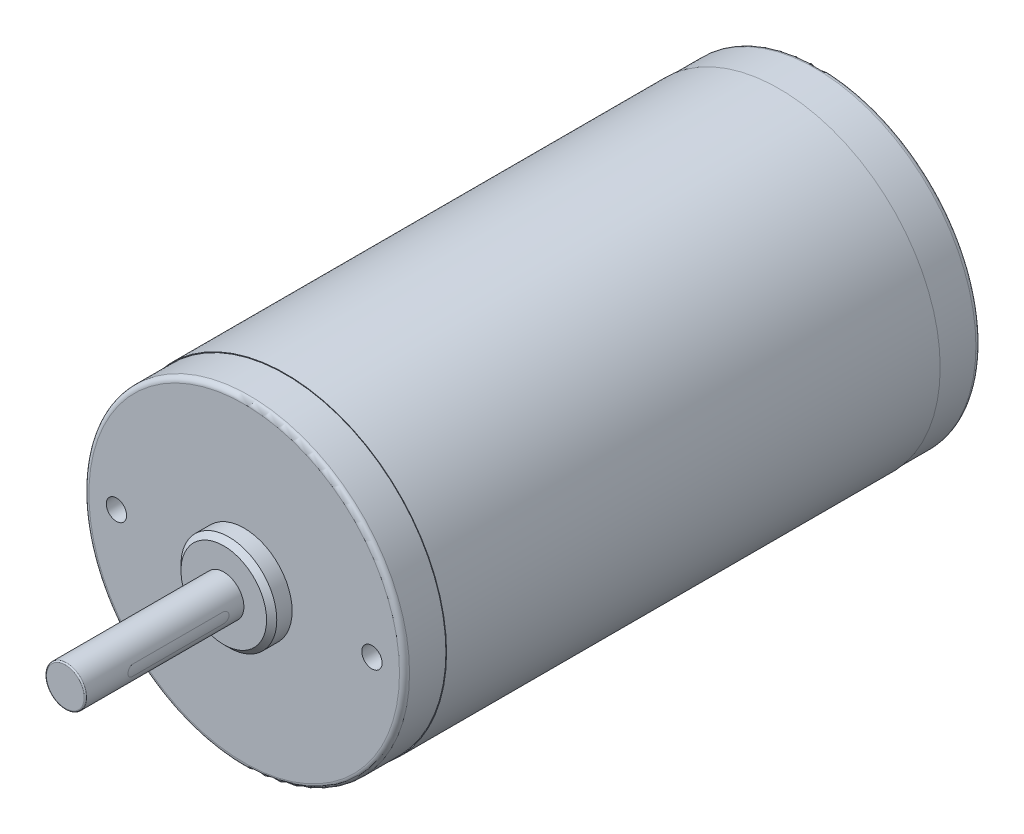
ISO-10303-21;
HEADER;
FILE_DESCRIPTION(('STEP AP214'),'2;1');
FILE_NAME('part.step','',(''),(''),'','','');
FILE_SCHEMA(('AUTOMOTIVE_DESIGN { 1 0 10303 214 1 1 1 1 }'));
ENDSEC;
DATA;
#1=APPLICATION_CONTEXT('core data for automotive mechanical design processes');
#2=APPLICATION_PROTOCOL_DEFINITION('international standard','automotive_design',2000,#1);
#3=PRODUCT_CONTEXT('',#1,'mechanical');
#4=PRODUCT('Part','Part','',(#3));
#5=PRODUCT_RELATED_PRODUCT_CATEGORY('part','',(#4));
#6=PRODUCT_DEFINITION_FORMATION('','',#4);
#7=PRODUCT_DEFINITION_CONTEXT('part definition',#1,'design');
#8=PRODUCT_DEFINITION('design','',#6,#7);
#9=PRODUCT_DEFINITION_SHAPE('','',#8);
#10=(LENGTH_UNIT() NAMED_UNIT(*) SI_UNIT(.MILLI.,.METRE.));
#11=(NAMED_UNIT(*) PLANE_ANGLE_UNIT() SI_UNIT($,.RADIAN.));
#12=(NAMED_UNIT(*) SI_UNIT($,.STERADIAN.) SOLID_ANGLE_UNIT());
#13=UNCERTAINTY_MEASURE_WITH_UNIT(LENGTH_MEASURE(1.E-05),#10,'distance_accuracy_value','');
#14=(GEOMETRIC_REPRESENTATION_CONTEXT(3) GLOBAL_UNCERTAINTY_ASSIGNED_CONTEXT((#13)) GLOBAL_UNIT_ASSIGNED_CONTEXT((#10,
#11,#12)) REPRESENTATION_CONTEXT('',''));
#15=CARTESIAN_POINT('',(0.,0.,0.));
#16=DIRECTION('',(0.,0.,1.));
#17=DIRECTION('',(1.,0.,0.));
#18=AXIS2_PLACEMENT_3D('',#15,#16,#17);
#19=CARTESIAN_POINT('',(35.56,109.2962,10.8204000000007));
#20=DIRECTION('',(0.,0.,-1.));
#21=DIRECTION('',(-1.,0.,0.));
#22=AXIS2_PLACEMENT_3D('',#19,#20,#21);
#23=CYLINDRICAL_SURFACE('',#22,32.0040000000005);
#24=CARTESIAN_POINT('',(35.56,109.2962,10.8204000000007));
#25=DIRECTION('',(0.,0.,-1.));
#26=DIRECTION('',(-1.,0.,0.));
#27=AXIS2_PLACEMENT_3D('',#24,#25,#26);
#28=CIRCLE('',#27,32.0040000000005);
#29=CARTESIAN_POINT('',(3.5559999999995,109.2962,10.8204000000007));
#30=VERTEX_POINT('',#29);
#31=EDGE_CURVE('P0_E178',#30,#30,#28,.T.);
#32=ORIENTED_EDGE('',*,*,#31,.T.);
#33=EDGE_LOOP('',(#32));
#34=FACE_BOUND('',#33,.T.);
#35=CARTESIAN_POINT('',(35.56,109.2962,-87.325199999998));
#36=DIRECTION('',(0.,0.,-1.));
#37=DIRECTION('',(-1.,0.,0.));
#38=AXIS2_PLACEMENT_3D('',#35,#36,#37);
#39=CIRCLE('',#38,32.0040000000005);
#40=CARTESIAN_POINT('',(3.5559999999995,109.2962,-87.325199999998));
#41=VERTEX_POINT('',#40);
#42=EDGE_CURVE('P0_E175',#41,#41,#39,.T.);
#43=ORIENTED_EDGE('',*,*,#42,.F.);
#44=EDGE_LOOP('',(#43));
#45=FACE_BOUND('',#44,.T.);
#46=ADVANCED_FACE('P0_F36',(#34,#45),#23,.T.);
#47=CARTESIAN_POINT('',(67.5640000000005,109.2962,10.8204000000007));
#48=DIRECTION('',(0.,0.,1.));
#49=DIRECTION('',(1.,0.,0.));
#50=AXIS2_PLACEMENT_3D('',#47,#48,#49);
#51=PLANE('',#50);
#52=CARTESIAN_POINT('',(35.56,109.2962,10.8204000000007));
#53=DIRECTION('',(0.,0.,1.));
#54=DIRECTION('',(1.,0.,0.));
#55=AXIS2_PLACEMENT_3D('',#52,#53,#54);
#56=CIRCLE('',#55,31.8770000000005);
#57=CARTESIAN_POINT('',(67.4370000000005,109.2962,10.8204000000007));
#58=VERTEX_POINT('',#57);
#59=EDGE_CURVE('P0_E166',#58,#58,#56,.T.);
#60=ORIENTED_EDGE('',*,*,#59,.F.);
#61=EDGE_LOOP('',(#60));
#62=FACE_BOUND('',#61,.T.);
#63=ORIENTED_EDGE('',*,*,#31,.F.);
#64=EDGE_LOOP('',(#63));
#65=FACE_BOUND('',#64,.T.);
#66=ADVANCED_FACE('P0_F225',(#62,#65),#51,.T.);
#67=CARTESIAN_POINT('',(35.56,109.2962,-87.325199999998));
#68=DIRECTION('',(0.,0.,-1.));
#69=DIRECTION('',(-1.,0.,0.));
#70=AXIS2_PLACEMENT_3D('',#67,#68,#69);
#71=PLANE('',#70);
#72=CARTESIAN_POINT('',(35.56,109.2962,-87.325199999998));
#73=DIRECTION('',(0.,0.,-1.));
#74=DIRECTION('',(-1.,0.,0.));
#75=AXIS2_PLACEMENT_3D('',#72,#73,#74);
#76=CIRCLE('',#75,31.8770000000005);
#77=CARTESIAN_POINT('',(3.68299999999951,109.2962,-87.325199999998));
#78=VERTEX_POINT('',#77);
#79=EDGE_CURVE('P0_E172',#78,#78,#76,.T.);
#80=ORIENTED_EDGE('',*,*,#79,.F.);
#81=EDGE_LOOP('',(#80));
#82=FACE_BOUND('',#81,.T.);
#83=ORIENTED_EDGE('',*,*,#42,.T.);
#84=EDGE_LOOP('',(#83));
#85=FACE_BOUND('',#84,.T.);
#86=ADVANCED_FACE('P0_F231',(#82,#85),#71,.T.);
#87=CARTESIAN_POINT('',(35.56,109.2962,-95.554799999998));
#88=DIRECTION('',(0.,0.,1.));
#89=DIRECTION('',(1.,0.,0.));
#90=AXIS2_PLACEMENT_3D('',#87,#88,#89);
#91=CYLINDRICAL_SURFACE('',#90,31.8770000000005);
#92=CARTESIAN_POINT('',(35.56,109.2962,-94.554799999998));
#93=DIRECTION('',(0.,0.,-1.));
#94=DIRECTION('',(-1.,0.,0.));
#95=AXIS2_PLACEMENT_3D('',#92,#93,#94);
#96=CIRCLE('',#95,31.8770000000005);
#97=CARTESIAN_POINT('',(3.68299999999951,109.2962,-94.554799999998));
#98=VERTEX_POINT('',#97);
#99=EDGE_CURVE('P0_E208',#98,#98,#96,.F.);
#100=ORIENTED_EDGE('',*,*,#99,.T.);
#101=EDGE_LOOP('',(#100));
#102=FACE_BOUND('',#101,.T.);
#103=ORIENTED_EDGE('',*,*,#79,.T.);
#104=EDGE_LOOP('',(#103));
#105=FACE_BOUND('',#104,.T.);
#106=ADVANCED_FACE('P0_F289',(#102,#105),#91,.T.);
#107=CARTESIAN_POINT('',(35.56,109.2962,-95.554799999998));
#108=DIRECTION('',(0.,0.,-1.));
#109=DIRECTION('',(-1.,0.,0.));
#110=AXIS2_PLACEMENT_3D('',#107,#108,#109);
#111=PLANE('',#110);
#112=CARTESIAN_POINT('',(35.56,109.2962,-95.554799999998));
#113=DIRECTION('',(0.,0.,-1.));
#114=DIRECTION('',(-1.,0.,0.));
#115=AXIS2_PLACEMENT_3D('',#112,#113,#114);
#116=CIRCLE('',#115,30.8770000000005);
#117=CARTESIAN_POINT('',(4.6829999999995,109.2962,-95.554799999998));
#118=VERTEX_POINT('',#117);
#119=EDGE_CURVE('P0_E205',#118,#118,#116,.T.);
#120=ORIENTED_EDGE('',*,*,#119,.T.);
#121=EDGE_LOOP('',(#120));
#122=FACE_BOUND('',#121,.T.);
#123=CARTESIAN_POINT('',(46.76735963712,127.903290682857,-95.554799999998));
#124=DIRECTION('',(0.,0.,-1.));
#125=DIRECTION('',(-1.,0.,0.));
#126=AXIS2_PLACEMENT_3D('',#123,#124,#125);
#127=CIRCLE('',#126,4.31800000197918);
#128=CARTESIAN_POINT('',(42.4493596351408,127.903290682857,-95.554799999998));
#129=VERTEX_POINT('',#128);
#130=EDGE_CURVE('P0_E184',#129,#129,#127,.T.);
#131=ORIENTED_EDGE('',*,*,#130,.F.);
#132=EDGE_LOOP('',(#131));
#133=FACE_BOUND('',#132,.T.);
#134=CARTESIAN_POINT('',(54.1670906808811,120.503559639095,-95.554799999998));
#135=DIRECTION('',(0.,0.,-1.));
#136=DIRECTION('',(-1.,0.,0.));
#137=AXIS2_PLACEMENT_3D('',#134,#135,#136);
#138=CIRCLE('',#137,4.3180000019652);
#139=CARTESIAN_POINT('',(49.8490906789159,120.503559639095,-95.554799999998));
#140=VERTEX_POINT('',#139);
#141=EDGE_CURVE('P0_E181',#140,#140,#138,.T.);
#142=ORIENTED_EDGE('',*,*,#141,.F.);
#143=EDGE_LOOP('',(#142));
#144=FACE_BOUND('',#143,.T.);
#145=CARTESIAN_POINT('',(35.56,109.2962,-95.554799999998));
#146=DIRECTION('',(0.,0.,-1.));
#147=DIRECTION('',(-1.,0.,0.));
#148=AXIS2_PLACEMENT_3D('',#145,#146,#147);
#149=CIRCLE('',#148,15.0368000000003);
#150=CARTESIAN_POINT('',(20.5231999999997,109.2962,-95.554799999998));
#151=VERTEX_POINT('',#150);
#152=EDGE_CURVE('P0_E169',#151,#151,#149,.T.);
#153=ORIENTED_EDGE('',*,*,#152,.F.);
#154=EDGE_LOOP('',(#153));
#155=FACE_BOUND('',#154,.T.);
#156=ADVANCED_FACE('P0_F285',(#122,#133,#144,#155),#111,.T.);
#157=CARTESIAN_POINT('',(35.56,109.2962,-100.317299999998));
#158=DIRECTION('',(0.,0.,1.));
#159=DIRECTION('',(1.,0.,0.));
#160=AXIS2_PLACEMENT_3D('',#157,#158,#159);
#161=CYLINDRICAL_SURFACE('',#160,15.0368000000003);
#162=CARTESIAN_POINT('',(35.56,109.2962,-99.317299999998));
#163=DIRECTION('',(0.,0.,-1.));
#164=DIRECTION('',(-1.,0.,0.));
#165=AXIS2_PLACEMENT_3D('',#162,#163,#164);
#166=CIRCLE('',#165,15.0368000000003);
#167=CARTESIAN_POINT('',(20.5231999999997,109.2962,-99.317299999998));
#168=VERTEX_POINT('',#167);
#169=EDGE_CURVE('P0_E11',#168,#168,#166,.F.);
#170=ORIENTED_EDGE('',*,*,#169,.T.);
#171=EDGE_LOOP('',(#170));
#172=FACE_BOUND('',#171,.T.);
#173=ORIENTED_EDGE('',*,*,#152,.T.);
#174=EDGE_LOOP('',(#173));
#175=FACE_BOUND('',#174,.T.);
#176=ADVANCED_FACE('P0_F282',(#172,#175),#161,.T.);
#177=CARTESIAN_POINT('',(35.56,109.2962,-100.317299999998));
#178=DIRECTION('',(0.,0.,-1.));
#179=DIRECTION('',(-1.,0.,0.));
#180=AXIS2_PLACEMENT_3D('',#177,#178,#179);
#181=PLANE('',#180);
#182=CARTESIAN_POINT('',(35.56,109.2962,-100.317299999998));
#183=DIRECTION('',(0.,0.,-1.));
#184=DIRECTION('',(-1.,0.,0.));
#185=AXIS2_PLACEMENT_3D('',#182,#183,#184);
#186=CIRCLE('',#185,14.0368000000003);
#187=CARTESIAN_POINT('',(21.5231999999997,109.2962,-100.317299999998));
#188=VERTEX_POINT('',#187);
#189=EDGE_CURVE('P0_E44',#188,#188,#186,.T.);
#190=ORIENTED_EDGE('',*,*,#189,.T.);
#191=EDGE_LOOP('',(#190));
#192=FACE_BOUND('',#191,.T.);
#193=ADVANCED_FACE('P0_F213',(#192),#181,.T.);
#194=CARTESIAN_POINT('',(35.56,109.2962,19.05));
#195=DIRECTION('',(0.,0.,-1.));
#196=DIRECTION('',(-1.,0.,0.));
#197=AXIS2_PLACEMENT_3D('',#194,#195,#196);
#198=CYLINDRICAL_SURFACE('',#197,31.8770000000005);
#199=CARTESIAN_POINT('',(35.56,109.2962,18.05));
#200=DIRECTION('',(0.,0.,1.));
#201=DIRECTION('',(1.,0.,0.));
#202=AXIS2_PLACEMENT_3D('',#199,#200,#201);
#203=CIRCLE('',#202,31.8770000000005);
#204=CARTESIAN_POINT('',(67.4370000000005,109.2962,18.05));
#205=VERTEX_POINT('',#204);
#206=EDGE_CURVE('P0_E202',#205,#205,#203,.F.);
#207=ORIENTED_EDGE('',*,*,#206,.T.);
#208=EDGE_LOOP('',(#207));
#209=FACE_BOUND('',#208,.T.);
#210=ORIENTED_EDGE('',*,*,#59,.T.);
#211=EDGE_LOOP('',(#210));
#212=FACE_BOUND('',#211,.T.);
#213=ADVANCED_FACE('P0_F257',(#209,#212),#198,.T.);
#214=CARTESIAN_POINT('',(35.56,109.2962,19.05));
#215=DIRECTION('',(0.,0.,1.));
#216=DIRECTION('',(1.,0.,0.));
#217=AXIS2_PLACEMENT_3D('',#214,#215,#216);
#218=PLANE('',#217);
#219=CARTESIAN_POINT('',(35.56,109.2962,19.05));
#220=DIRECTION('',(0.,0.,1.));
#221=DIRECTION('',(1.,0.,0.));
#222=AXIS2_PLACEMENT_3D('',#219,#220,#221);
#223=CIRCLE('',#222,30.8770000000005);
#224=CARTESIAN_POINT('',(66.4370000000005,109.2962,19.05));
#225=VERTEX_POINT('',#224);
#226=EDGE_CURVE('P0_E199',#225,#225,#223,.T.);
#227=ORIENTED_EDGE('',*,*,#226,.T.);
#228=EDGE_LOOP('',(#227));
#229=FACE_BOUND('',#228,.T.);
#230=CARTESIAN_POINT('',(10.1599999999994,109.2962,19.05));
#231=DIRECTION('',(0.,0.,1.));
#232=DIRECTION('',(1.,0.,0.));
#233=AXIS2_PLACEMENT_3D('',#230,#231,#232);
#234=CIRCLE('',#233,2.01930000000002);
#235=CARTESIAN_POINT('',(12.1792999999994,109.2962,19.05));
#236=VERTEX_POINT('',#235);
#237=EDGE_CURVE('P0_E93',#236,#236,#234,.T.);
#238=ORIENTED_EDGE('',*,*,#237,.F.);
#239=EDGE_LOOP('',(#238));
#240=FACE_BOUND('',#239,.T.);
#241=CARTESIAN_POINT('',(60.96,109.2962,19.05));
#242=DIRECTION('',(0.,0.,1.));
#243=DIRECTION('',(1.,0.,0.));
#244=AXIS2_PLACEMENT_3D('',#241,#242,#243);
#245=CIRCLE('',#244,2.01930000000002);
#246=CARTESIAN_POINT('',(62.9793,109.2962,19.05));
#247=VERTEX_POINT('',#246);
#248=EDGE_CURVE('P0_E92',#247,#247,#245,.T.);
#249=ORIENTED_EDGE('',*,*,#248,.F.);
#250=EDGE_LOOP('',(#249));
#251=FACE_BOUND('',#250,.T.);
#252=CARTESIAN_POINT('',(35.56,109.2962,19.05));
#253=DIRECTION('',(0.,0.,1.));
#254=DIRECTION('',(1.,0.,0.));
#255=AXIS2_PLACEMENT_3D('',#252,#253,#254);
#256=CIRCLE('',#255,9.52500000000019);
#257=CARTESIAN_POINT('',(45.0850000000002,109.2962,19.05));
#258=VERTEX_POINT('',#257);
#259=EDGE_CURVE('P0_E163',#258,#258,#256,.T.);
#260=ORIENTED_EDGE('',*,*,#259,.F.);
#261=EDGE_LOOP('',(#260));
#262=FACE_BOUND('',#261,.T.);
#263=ADVANCED_FACE('P0_F253',(#229,#240,#251,#262),#218,.T.);
#264=CARTESIAN_POINT('',(35.56,109.2962,23.114));
#265=DIRECTION('',(0.,0.,-1.));
#266=DIRECTION('',(-1.,0.,0.));
#267=AXIS2_PLACEMENT_3D('',#264,#265,#266);
#268=CYLINDRICAL_SURFACE('',#267,9.52500000000019);
#269=CARTESIAN_POINT('',(35.56,109.2962,22.0980000018232));
#270=DIRECTION('',(0.,0.,1.));
#271=DIRECTION('',(1.,0.,0.));
#272=AXIS2_PLACEMENT_3D('',#269,#270,#271);
#273=CIRCLE('',#272,9.52500000000019);
#274=CARTESIAN_POINT('',(45.0850000000002,109.2962,22.0980000018232));
#275=VERTEX_POINT('',#274);
#276=EDGE_CURVE('P0_E190',#275,#275,#273,.F.);
#277=ORIENTED_EDGE('',*,*,#276,.T.);
#278=EDGE_LOOP('',(#277));
#279=FACE_BOUND('',#278,.T.);
#280=ORIENTED_EDGE('',*,*,#259,.T.);
#281=EDGE_LOOP('',(#280));
#282=FACE_BOUND('',#281,.T.);
#283=ADVANCED_FACE('P0_F256',(#279,#282),#268,.T.);
#284=CARTESIAN_POINT('',(35.56,109.2962,23.114));
#285=DIRECTION('',(0.,0.,1.));
#286=DIRECTION('',(1.,0.,0.));
#287=AXIS2_PLACEMENT_3D('',#284,#285,#286);
#288=PLANE('',#287);
#289=CARTESIAN_POINT('',(35.56,109.2962,23.114));
#290=DIRECTION('',(0.,0.,1.));
#291=DIRECTION('',(1.,0.,0.));
#292=AXIS2_PLACEMENT_3D('',#289,#290,#291);
#293=CIRCLE('',#292,8.50899999999979);
#294=CARTESIAN_POINT('',(44.0689999999998,109.2962,23.114));
#295=VERTEX_POINT('',#294);
#296=EDGE_CURVE('P0_E187',#295,#295,#293,.T.);
#297=ORIENTED_EDGE('',*,*,#296,.T.);
#298=EDGE_LOOP('',(#297));
#299=FACE_BOUND('',#298,.T.);
#300=CARTESIAN_POINT('',(35.56,109.2962,23.114));
#301=DIRECTION('',(0.,0.,1.));
#302=DIRECTION('',(1.,0.,0.));
#303=AXIS2_PLACEMENT_3D('',#300,#301,#302);
#304=CIRCLE('',#303,4.00000000000007);
#305=CARTESIAN_POINT('',(39.5600000000001,109.2962,23.114));
#306=VERTEX_POINT('',#305);
#307=EDGE_CURVE('P0_E119',#306,#306,#304,.T.);
#308=ORIENTED_EDGE('',*,*,#307,.F.);
#309=EDGE_LOOP('',(#308));
#310=FACE_BOUND('',#309,.T.);
#311=ADVANCED_FACE('P0_F266',(#299,#310),#288,.T.);
#312=CARTESIAN_POINT('',(35.56,109.2962,54.614));
#313=DIRECTION('',(0.,0.,-1.));
#314=DIRECTION('',(-1.,0.,0.));
#315=AXIS2_PLACEMENT_3D('',#312,#313,#314);
#316=CYLINDRICAL_SURFACE('',#315,4.00000000000007);
#317=CARTESIAN_POINT('',(35.56,109.2962,54.36));
#318=DIRECTION('',(0.,0.,1.));
#319=DIRECTION('',(1.,0.,0.));
#320=AXIS2_PLACEMENT_3D('',#317,#318,#319);
#321=CIRCLE('',#320,4.00000000000007);
#322=CARTESIAN_POINT('',(39.5600000000001,109.2962,54.36));
#323=VERTEX_POINT('',#322);
#324=EDGE_CURVE('P0_E196',#323,#323,#321,.F.);
#325=ORIENTED_EDGE('',*,*,#324,.T.);
#326=EDGE_LOOP('',(#325));
#327=FACE_BOUND('',#326,.T.);
#328=DIRECTION('',(0.,0.,-1.));
#329=VECTOR('',#328,1.);
#330=CARTESIAN_POINT('',(39.4197279696891,110.3462,54.614));
#331=LINE('',#330,#329);
#332=CARTESIAN_POINT('',(39.4197279696891,110.3462,45.1));
#333=VERTEX_POINT('',#332);
#334=CARTESIAN_POINT('',(39.4197279696891,110.3462,27.1));
#335=VERTEX_POINT('',#334);
#336=EDGE_CURVE('P0_E129',#333,#335,#331,.T.);
#337=ORIENTED_EDGE('',*,*,#336,.T.);
#338=CARTESIAN_POINT('',(39.4197279696891,110.3462,27.1));
#339=CARTESIAN_POINT('',(39.4197258950768,110.34620041025,27.0710051009623));
#340=CARTESIAN_POINT('',(39.4200551064329,110.344998227256,27.0420246228058));
#341=CARTESIAN_POINT('',(39.4213547123988,110.340206209835,26.9842814282389));
#342=CARTESIAN_POINT('',(39.4223249908093,110.336616808112,26.9555186733196));
#343=CARTESIAN_POINT('',(39.4261578920524,110.322321932764,26.8699951160553));
#344=CARTESIAN_POINT('',(39.4299428342912,110.308089542303,26.8138236492985));
#345=CARTESIAN_POINT('',(39.4395286889104,110.270686835054,26.7047742036821));
#346=CARTESIAN_POINT('',(39.445329326456,110.247517736714,26.6518957769836));
#347=CARTESIAN_POINT('',(39.4582892232805,110.192930496084,26.5507488556207));
#348=CARTESIAN_POINT('',(39.4654488628844,110.161510043656,26.5024816571346));
#349=CARTESIAN_POINT('',(39.4805119710478,110.090509636998,26.4107922298844));
#350=CARTESIAN_POINT('',(39.4884281885094,110.050767743087,26.3674975328551));
#351=CARTESIAN_POINT('',(39.5040047400555,109.964586854037,26.2880931254825));
#352=CARTESIAN_POINT('',(39.5116649818293,109.91814547434,26.2519859843525));
#353=CARTESIAN_POINT('',(39.526010604883,109.818987620195,26.1874496103786));
#354=CARTESIAN_POINT('',(39.5326785635433,109.766183168704,26.159151481312));
#355=CARTESIAN_POINT('',(39.5441298010583,109.656397945762,26.1119111599868));
#356=CARTESIAN_POINT('',(39.5489153447307,109.599422291421,26.0929577177131));
#357=CARTESIAN_POINT('',(39.5549473168842,109.501171577289,26.0693758272655));
#358=CARTESIAN_POINT('',(39.5568321627736,109.46054623456,26.0621227253234));
#359=CARTESIAN_POINT('',(39.5593590428507,109.378686103609,26.052433965248));
#360=CARTESIAN_POINT('',(39.560001100914,109.337451327111,26.0499982145665));
#361=CARTESIAN_POINT('',(39.5599984549201,109.238305738357,26.0500025057704));
#362=CARTESIAN_POINT('',(39.5587300938834,109.18037887734,26.0548061723029));
#363=CARTESIAN_POINT('',(39.5537908073877,109.066174828257,26.0738680806171));
#364=CARTESIAN_POINT('',(39.5501176251492,109.009899241695,26.0881352034471));
#365=CARTESIAN_POINT('',(39.5407752151886,108.900688958064,26.1256289904428));
#366=CARTESIAN_POINT('',(39.5351088856793,108.847749541003,26.148842650214));
#367=CARTESIAN_POINT('',(39.5223803452478,108.746519851806,26.2035277086069));
#368=CARTESIAN_POINT('',(39.5153181479083,108.698229534436,26.2349990268771));
#369=CARTESIAN_POINT('',(39.5003832391547,108.606575585264,26.3060552920619));
#370=CARTESIAN_POINT('',(39.4924970081334,108.563331555532,26.3457916691671));
#371=CARTESIAN_POINT('',(39.4768899553604,108.484036309153,26.431929982209));
#372=CARTESIAN_POINT('',(39.4691691622905,108.447986330864,26.4783330633665));
#373=CARTESIAN_POINT('',(39.4546281048764,108.383519395399,26.5774412854526));
#374=CARTESIAN_POINT('',(39.447825217303,108.355241372008,26.6302394851058));
#375=CARTESIAN_POINT('',(39.4360941322255,108.308025058775,26.7400354515098));
#376=CARTESIAN_POINT('',(39.4311644713835,108.289079475123,26.7970298984879));
#377=CARTESIAN_POINT('',(39.424947536189,108.265530062073,26.8952701656664));
#378=CARTESIAN_POINT('',(39.4230031721686,108.258293447667,26.9358624533813));
#379=CARTESIAN_POINT('',(39.4203876966156,108.248624950633,27.0176289590907));
#380=CARTESIAN_POINT('',(39.419715789786,108.246190066839,27.058802797386));
#381=CARTESIAN_POINT('',(39.4197279696891,108.2462,27.1));
#382=B_SPLINE_CURVE_WITH_KNOTS('',3,(#338,#339,#340,#341,#342,#343,#344,#345,#346,#347,#348,
#349,#350,#351,#352,#353,#354,#355,#356,#357,#358,#359,#360,#361,#362,#363,#364,#365,#366,#367,
#368,#369,#370,#371,#372,#373,#374,#375,#376,#377,#378,#379,#380,#381),.UNSPECIFIED.,.F.,.F.,(4,
2,2,2,2,2,2,2,2,2,2,2,2,2,2,2,2,2,2,2,2,4),(0.,0.0869295778834455,0.173843403286115,
0.347151826879623,0.520436629596136,0.693769998810197,0.870856390838592,1.0480059697082,
1.22797015523124,1.40771715061754,1.53136439682191,1.65500926755904,1.82853892099358,
2.00223165541559,2.17567286221396,2.34911238140168,2.52606492372391,2.7030478997598,
2.88301467869372,3.06284057971519,3.18638852057381,3.30985921734618),.UNSPECIFIED.);
#383=CARTESIAN_POINT('',(39.4197279696891,108.2462,27.1));
#384=VERTEX_POINT('',#383);
#385=EDGE_CURVE('P0_E115',#335,#384,#382,.T.);
#386=ORIENTED_EDGE('',*,*,#385,.T.);
#387=DIRECTION('',(0.,0.,-1.));
#388=VECTOR('',#387,1.);
#389=CARTESIAN_POINT('',(39.4197279696891,108.2462,54.614));
#390=LINE('',#389,#388);
#391=CARTESIAN_POINT('',(39.4197279696891,108.2462,45.1));
#392=VERTEX_POINT('',#391);
#393=EDGE_CURVE('P0_E142',#384,#392,#390,.F.);
#394=ORIENTED_EDGE('',*,*,#393,.T.);
#395=CARTESIAN_POINT('',(39.4197279696891,108.2462,45.1));
#396=CARTESIAN_POINT('',(39.4197258950768,108.24619958975,45.1289948990377));
#397=CARTESIAN_POINT('',(39.4200551064328,108.247401772744,45.1579753771942));
#398=CARTESIAN_POINT('',(39.4213547123988,108.252193790165,45.2157185717611));
#399=CARTESIAN_POINT('',(39.4223249908093,108.255783191888,45.2444813266804));
#400=CARTESIAN_POINT('',(39.4261578920524,108.270078067236,45.3300048839447));
#401=CARTESIAN_POINT('',(39.4299428342912,108.284310457697,45.3861763507014));
#402=CARTESIAN_POINT('',(39.4395286889104,108.321713164946,45.4952257963179));
#403=CARTESIAN_POINT('',(39.445329326456,108.344882263286,45.5481042230163));
#404=CARTESIAN_POINT('',(39.4582892232805,108.399469503916,45.6492511443793));
#405=CARTESIAN_POINT('',(39.4654488628844,108.430889956344,45.6975183428654));
#406=CARTESIAN_POINT('',(39.4805119710478,108.501890363002,45.7892077701155));
#407=CARTESIAN_POINT('',(39.4884281885094,108.541632256913,45.8325024671448));
#408=CARTESIAN_POINT('',(39.5040047400555,108.627813145963,45.9119068745175));
#409=CARTESIAN_POINT('',(39.5116649818293,108.67425452566,45.9480140156475));
#410=CARTESIAN_POINT('',(39.526010604883,108.773412379805,46.0125503896214));
#411=CARTESIAN_POINT('',(39.5326785635433,108.826216831296,46.040848518688));
#412=CARTESIAN_POINT('',(39.5441298010583,108.936002054238,46.0880888400132));
#413=CARTESIAN_POINT('',(39.5489153447307,108.992977708579,46.1070422822868));
#414=CARTESIAN_POINT('',(39.5549473168842,109.091228422711,46.1306241727345));
#415=CARTESIAN_POINT('',(39.5568321627736,109.13185376544,46.1378772746766));
#416=CARTESIAN_POINT('',(39.5593590428507,109.213713896391,46.147566034752));
#417=CARTESIAN_POINT('',(39.560001100914,109.254948672889,46.1500017854335));
#418=CARTESIAN_POINT('',(39.5599984549201,109.354094261643,46.1499974942296));
#419=CARTESIAN_POINT('',(39.5587300938834,109.412021122661,46.1451938276971));
#420=CARTESIAN_POINT('',(39.5537908073877,109.526225171743,46.1261319193829));
#421=CARTESIAN_POINT('',(39.5501176251492,109.582500758305,46.1118647965529));
#422=CARTESIAN_POINT('',(39.5407752151886,109.691711041936,46.0743710095572));
#423=CARTESIAN_POINT('',(39.5351088856793,109.744650458997,46.051157349786));
#424=CARTESIAN_POINT('',(39.5223803452478,109.845880148194,45.9964722913931));
#425=CARTESIAN_POINT('',(39.5153181479083,109.894170465564,45.9650009731229));
#426=CARTESIAN_POINT('',(39.5003832391547,109.985824414736,45.8939447079381));
#427=CARTESIAN_POINT('',(39.4924970081334,110.029068444468,45.8542083308329));
#428=CARTESIAN_POINT('',(39.4768899553604,110.108363690847,45.768070017791));
#429=CARTESIAN_POINT('',(39.4691691622905,110.144413669136,45.7216669366335));
#430=CARTESIAN_POINT('',(39.4546281048764,110.208880604601,45.6225587145474));
#431=CARTESIAN_POINT('',(39.447825217303,110.237158627992,45.5697605148942));
#432=CARTESIAN_POINT('',(39.4360941322255,110.284374941225,45.4599645484902));
#433=CARTESIAN_POINT('',(39.4311644713835,110.303320524877,45.4029701015121));
#434=CARTESIAN_POINT('',(39.424947536189,110.326869937927,45.3047298343336));
#435=CARTESIAN_POINT('',(39.4230031721686,110.334106552333,45.2641375466187));
#436=CARTESIAN_POINT('',(39.4203876966156,110.343775049367,45.1823710409093));
#437=CARTESIAN_POINT('',(39.419715789786,110.346209933161,45.141197202614));
#438=CARTESIAN_POINT('',(39.4197279696891,110.3462,45.1));
#439=B_SPLINE_CURVE_WITH_KNOTS('',3,(#395,#396,#397,#398,#399,#400,#401,#402,#403,#404,#405,
#406,#407,#408,#409,#410,#411,#412,#413,#414,#415,#416,#417,#418,#419,#420,#421,#422,#423,#424,
#425,#426,#427,#428,#429,#430,#431,#432,#433,#434,#435,#436,#437,#438),.UNSPECIFIED.,.F.,.F.,(4,
2,2,2,2,2,2,2,2,2,2,2,2,2,2,2,2,2,2,2,2,4),(0.,0.0869295778834422,0.17384340328612,
0.347151826879625,0.520436629596116,0.69376999881019,0.870856390838584,1.04800596970821,
1.22797015523126,1.40771715061754,1.53136439682193,1.65500926755904,1.82853892099362,
2.0022316554156,2.17567286221397,2.34911238140169,2.52606492372393,2.70304789975981,
2.88301467869373,3.0628405797152,3.18638852057382,3.3098592173462),.UNSPECIFIED.);
#440=EDGE_CURVE('P0_E51',#392,#333,#439,.T.);
#441=ORIENTED_EDGE('',*,*,#440,.T.);
#442=EDGE_LOOP('',(#337,#386,#394,#441));
#443=FACE_BOUND('',#442,.T.);
#444=ORIENTED_EDGE('',*,*,#307,.T.);
#445=EDGE_LOOP('',(#444));
#446=FACE_BOUND('',#445,.T.);
#447=ADVANCED_FACE('P0_F272',(#327,#443,#446),#316,.T.);
#448=CARTESIAN_POINT('',(35.56,109.2962,54.614));
#449=DIRECTION('',(0.,0.,1.));
#450=DIRECTION('',(1.,0.,0.));
#451=AXIS2_PLACEMENT_3D('',#448,#449,#450);
#452=PLANE('',#451);
#453=CARTESIAN_POINT('',(35.56,109.2962,54.614));
#454=DIRECTION('',(0.,0.,1.));
#455=DIRECTION('',(1.,0.,0.));
#456=AXIS2_PLACEMENT_3D('',#453,#454,#455);
#457=CIRCLE('',#456,3.74600000000007);
#458=CARTESIAN_POINT('',(39.3060000000001,109.2962,54.614));
#459=VERTEX_POINT('',#458);
#460=EDGE_CURVE('P0_E193',#459,#459,#457,.T.);
#461=ORIENTED_EDGE('',*,*,#460,.T.);
#462=EDGE_LOOP('',(#461));
#463=FACE_BOUND('',#462,.T.);
#464=ADVANCED_FACE('P0_F482',(#463),#452,.T.);
#465=CARTESIAN_POINT('',(67.5650000000005,109.2962,27.1));
#466=DIRECTION('',(-1.,0.,0.));
#467=DIRECTION('',(0.,0.,1.));
#468=AXIS2_PLACEMENT_3D('',#465,#466,#467);
#469=CYLINDRICAL_SURFACE('',#468,1.05);
#470=ORIENTED_EDGE('',*,*,#385,.F.);
#471=DIRECTION('',(-1.,0.,0.));
#472=VECTOR('',#471,1.);
#473=CARTESIAN_POINT('',(67.5650000000005,110.3462,27.1));
#474=LINE('',#473,#472);
#475=CARTESIAN_POINT('',(38.3600000000001,110.3462,27.1));
#476=VERTEX_POINT('',#475);
#477=EDGE_CURVE('P0_E133',#335,#476,#474,.T.);
#478=ORIENTED_EDGE('',*,*,#477,.T.);
#479=CARTESIAN_POINT('',(38.3600000000001,109.2962,27.1));
#480=DIRECTION('',(-1.,0.,0.));
#481=DIRECTION('',(0.,0.,1.));
#482=AXIS2_PLACEMENT_3D('',#479,#480,#481);
#483=CIRCLE('',#482,1.05);
#484=CARTESIAN_POINT('',(38.3600000000001,108.2462,27.1));
#485=VERTEX_POINT('',#484);
#486=EDGE_CURVE('P0_E126',#476,#485,#483,.T.);
#487=ORIENTED_EDGE('',*,*,#486,.T.);
#488=DIRECTION('',(-1.,0.,0.));
#489=VECTOR('',#488,1.);
#490=CARTESIAN_POINT('',(67.5650000000005,108.2462,27.1));
#491=LINE('',#490,#489);
#492=EDGE_CURVE('P0_E59',#384,#485,#491,.T.);
#493=ORIENTED_EDGE('',*,*,#492,.F.);
#494=EDGE_LOOP('',(#470,#478,#487,#493));
#495=FACE_BOUND('',#494,.T.);
#496=ADVANCED_FACE('P0_F473',(#495),#469,.F.);
#497=CARTESIAN_POINT('',(67.5650000000005,110.3462,45.1));
#498=DIRECTION('',(0.,1.,0.));
#499=DIRECTION('',(0.,0.,1.));
#500=AXIS2_PLACEMENT_3D('',#497,#498,#499);
#501=PLANE('',#500);
#502=ORIENTED_EDGE('',*,*,#336,.F.);
#503=DIRECTION('',(-1.,0.,0.));
#504=VECTOR('',#503,1.);
#505=CARTESIAN_POINT('',(67.5650000000005,110.3462,45.1));
#506=LINE('',#505,#504);
#507=CARTESIAN_POINT('',(38.3600000000001,110.3462,45.1));
#508=VERTEX_POINT('',#507);
#509=EDGE_CURVE('P0_E156',#333,#508,#506,.T.);
#510=ORIENTED_EDGE('',*,*,#509,.T.);
#511=DIRECTION('',(0.,0.,-1.));
#512=VECTOR('',#511,1.);
#513=CARTESIAN_POINT('',(38.3600000000001,110.3462,45.1));
#514=LINE('',#513,#512);
#515=EDGE_CURVE('P0_E116',#508,#476,#514,.T.);
#516=ORIENTED_EDGE('',*,*,#515,.T.);
#517=ORIENTED_EDGE('',*,*,#477,.F.);
#518=EDGE_LOOP('',(#502,#510,#516,#517));
#519=FACE_BOUND('',#518,.T.);
#520=ADVANCED_FACE('P0_F465',(#519),#501,.F.);
#521=CARTESIAN_POINT('',(67.5650000000005,109.2962,45.1));
#522=DIRECTION('',(-1.,0.,0.));
#523=DIRECTION('',(0.,0.,1.));
#524=AXIS2_PLACEMENT_3D('',#521,#522,#523);
#525=CYLINDRICAL_SURFACE('',#524,1.05);
#526=ORIENTED_EDGE('',*,*,#440,.F.);
#527=DIRECTION('',(-1.,0.,0.));
#528=VECTOR('',#527,1.);
#529=CARTESIAN_POINT('',(67.5650000000005,108.2462,45.1));
#530=LINE('',#529,#528);
#531=CARTESIAN_POINT('',(38.3600000000001,108.2462,45.1));
#532=VERTEX_POINT('',#531);
#533=EDGE_CURVE('P0_E128',#392,#532,#530,.T.);
#534=ORIENTED_EDGE('',*,*,#533,.T.);
#535=CARTESIAN_POINT('',(38.3600000000001,109.2962,45.1));
#536=DIRECTION('',(-1.,0.,0.));
#537=DIRECTION('',(0.,0.,1.));
#538=AXIS2_PLACEMENT_3D('',#535,#536,#537);
#539=CIRCLE('',#538,1.05);
#540=EDGE_CURVE('P0_E120',#532,#508,#539,.T.);
#541=ORIENTED_EDGE('',*,*,#540,.T.);
#542=ORIENTED_EDGE('',*,*,#509,.F.);
#543=EDGE_LOOP('',(#526,#534,#541,#542));
#544=FACE_BOUND('',#543,.T.);
#545=ADVANCED_FACE('P0_F457',(#544),#525,.F.);
#546=CARTESIAN_POINT('',(67.5650000000005,108.2462,27.1));
#547=DIRECTION('',(0.,-1.,0.));
#548=DIRECTION('',(0.,0.,-1.));
#549=AXIS2_PLACEMENT_3D('',#546,#547,#548);
#550=PLANE('',#549);
#551=ORIENTED_EDGE('',*,*,#393,.F.);
#552=ORIENTED_EDGE('',*,*,#492,.T.);
#553=DIRECTION('',(0.,0.,1.));
#554=VECTOR('',#553,1.);
#555=CARTESIAN_POINT('',(38.3600000000001,108.2462,27.1));
#556=LINE('',#555,#554);
#557=EDGE_CURVE('P0_E123',#485,#532,#556,.T.);
#558=ORIENTED_EDGE('',*,*,#557,.T.);
#559=ORIENTED_EDGE('',*,*,#533,.F.);
#560=EDGE_LOOP('',(#551,#552,#558,#559));
#561=FACE_BOUND('',#560,.T.);
#562=ADVANCED_FACE('P0_F449',(#561),#550,.F.);
#563=CARTESIAN_POINT('',(38.3600000000001,109.2962,27.1));
#564=DIRECTION('',(-1.,0.,0.));
#565=DIRECTION('',(0.,0.,1.));
#566=AXIS2_PLACEMENT_3D('',#563,#564,#565);
#567=PLANE('',#566);
#568=ORIENTED_EDGE('',*,*,#486,.F.);
#569=ORIENTED_EDGE('',*,*,#515,.F.);
#570=ORIENTED_EDGE('',*,*,#540,.F.);
#571=ORIENTED_EDGE('',*,*,#557,.F.);
#572=EDGE_LOOP('',(#568,#569,#570,#571));
#573=FACE_BOUND('',#572,.T.);
#574=ADVANCED_FACE('P0_F440',(#573),#567,.F.);
#575=CARTESIAN_POINT('',(54.1670906808811,120.503559639095,-95.554799999998));
#576=DIRECTION('',(0.,0.,-1.));
#577=DIRECTION('',(-1.,0.,0.));
#578=AXIS2_PLACEMENT_3D('',#575,#576,#577);
#579=CYLINDRICAL_SURFACE('',#578,4.3180000019652);
#580=ORIENTED_EDGE('',*,*,#141,.T.);
#581=EDGE_LOOP('',(#580));
#582=FACE_BOUND('',#581,.T.);
#583=CARTESIAN_POINT('',(54.1670906808811,120.503559639095,-95.6026999960083));
#584=DIRECTION('',(0.,0.,-1.));
#585=DIRECTION('',(-1.,0.,0.));
#586=AXIS2_PLACEMENT_3D('',#583,#584,#585);
#587=CIRCLE('',#586,4.3180000019652);
#588=CARTESIAN_POINT('',(49.8490906789159,120.503559639095,-95.6026999960083));
#589=VERTEX_POINT('',#588);
#590=EDGE_CURVE('P0_E109',#589,#589,#587,.T.);
#591=ORIENTED_EDGE('',*,*,#590,.F.);
#592=EDGE_LOOP('',(#591));
#593=FACE_BOUND('',#592,.T.);
#594=ADVANCED_FACE('P0_F431',(#582,#593),#579,.T.);
#595=CARTESIAN_POINT('',(54.1670906808811,120.503559639095,-97.8026999980238));
#596=DIRECTION('',(0.,0.,-1.));
#597=DIRECTION('',(-1.,0.,0.));
#598=AXIS2_PLACEMENT_3D('',#595,#596,#597);
#599=PLANE('',#598);
#600=CARTESIAN_POINT('',(54.1670906808811,120.503559639095,-97.8026999980238));
#601=DIRECTION('',(0.,0.,-1.));
#602=DIRECTION('',(-1.,0.,0.));
#603=AXIS2_PLACEMENT_3D('',#600,#601,#602);
#604=CIRCLE('',#603,2.11799999994966);
#605=CARTESIAN_POINT('',(52.0490906809314,120.503559639095,-97.8026999980238));
#606=VERTEX_POINT('',#605);
#607=EDGE_CURVE('P0_E112',#606,#606,#604,.T.);
#608=ORIENTED_EDGE('',*,*,#607,.T.);
#609=EDGE_LOOP('',(#608));
#610=FACE_BOUND('',#609,.T.);
#611=ADVANCED_FACE('P0_F422',(#610),#599,.T.);
#612=CARTESIAN_POINT('',(54.1670906808811,120.503559639095,-97.8026999980238));
#613=DIRECTION('',(0.,0.,1.));
#614=DIRECTION('',(1.,0.,0.));
#615=AXIS2_PLACEMENT_3D('',#612,#613,#614);
#616=CONICAL_SURFACE('',#615,2.11799999994966,0.78539816339745);
#617=ORIENTED_EDGE('',*,*,#590,.T.);
#618=EDGE_LOOP('',(#617));
#619=FACE_BOUND('',#618,.T.);
#620=ORIENTED_EDGE('',*,*,#607,.F.);
#621=EDGE_LOOP('',(#620));
#622=FACE_BOUND('',#621,.T.);
#623=ADVANCED_FACE('P0_F413',(#619,#622),#616,.T.);
#624=CARTESIAN_POINT('',(46.76735963712,127.903290682857,-95.554799999998));
#625=DIRECTION('',(0.,0.,-1.));
#626=DIRECTION('',(-1.,0.,0.));
#627=AXIS2_PLACEMENT_3D('',#624,#625,#626);
#628=CYLINDRICAL_SURFACE('',#627,4.31800000197918);
#629=ORIENTED_EDGE('',*,*,#130,.T.);
#630=EDGE_LOOP('',(#629));
#631=FACE_BOUND('',#630,.T.);
#632=CARTESIAN_POINT('',(46.76735963712,127.903290682857,-95.6026999960785));
#633=DIRECTION('',(0.,0.,-1.));
#634=DIRECTION('',(-1.,0.,0.));
#635=AXIS2_PLACEMENT_3D('',#632,#633,#634);
#636=CIRCLE('',#635,4.31800000197918);
#637=CARTESIAN_POINT('',(42.4493596351408,127.903290682857,-95.6026999960785));
#638=VERTEX_POINT('',#637);
#639=EDGE_CURVE('P0_E103',#638,#638,#636,.T.);
#640=ORIENTED_EDGE('',*,*,#639,.F.);
#641=EDGE_LOOP('',(#640));
#642=FACE_BOUND('',#641,.T.);
#643=ADVANCED_FACE('P0_F404',(#631,#642),#628,.T.);
#644=CARTESIAN_POINT('',(46.76735963712,127.903290682857,-97.8026999980236));
#645=DIRECTION('',(0.,0.,-1.));
#646=DIRECTION('',(-1.,0.,0.));
#647=AXIS2_PLACEMENT_3D('',#644,#645,#646);
#648=PLANE('',#647);
#649=CARTESIAN_POINT('',(46.76735963712,127.903290682857,-97.8026999980236));
#650=DIRECTION('',(0.,0.,-1.));
#651=DIRECTION('',(-1.,0.,0.));
#652=AXIS2_PLACEMENT_3D('',#649,#650,#651);
#653=CIRCLE('',#652,2.11800000003411);
#654=CARTESIAN_POINT('',(44.6493596370859,127.903290682857,-97.8026999980236));
#655=VERTEX_POINT('',#654);
#656=EDGE_CURVE('P0_E106',#655,#655,#653,.T.);
#657=ORIENTED_EDGE('',*,*,#656,.T.);
#658=EDGE_LOOP('',(#657));
#659=FACE_BOUND('',#658,.T.);
#660=ADVANCED_FACE('P0_F395',(#659),#648,.T.);
#661=CARTESIAN_POINT('',(46.76735963712,127.903290682857,-97.8026999980236));
#662=DIRECTION('',(0.,0.,1.));
#663=DIRECTION('',(1.,0.,0.));
#664=AXIS2_PLACEMENT_3D('',#661,#662,#663);
#665=CONICAL_SURFACE('',#664,2.11800000003411,0.785398163397448);
#666=ORIENTED_EDGE('',*,*,#639,.T.);
#667=EDGE_LOOP('',(#666));
#668=FACE_BOUND('',#667,.T.);
#669=ORIENTED_EDGE('',*,*,#656,.F.);
#670=EDGE_LOOP('',(#669));
#671=FACE_BOUND('',#670,.T.);
#672=ADVANCED_FACE('P0_F386',(#668,#671),#665,.T.);
#673=CARTESIAN_POINT('',(60.96,109.2962,5.4356000000007));
#674=DIRECTION('',(0.,0.,1.));
#675=DIRECTION('',(1.,0.,0.));
#676=AXIS2_PLACEMENT_3D('',#673,#674,#675);
#677=CONICAL_SURFACE('',#676,2.01930000000002,1.02974425747654);
#678=CARTESIAN_POINT('',(60.96,109.2962,4.22228214870002));
#679=VERTEX_POINT('',#678);
#680=VERTEX_LOOP('',#679);
#681=FACE_BOUND('',#680,.T.);
#682=CARTESIAN_POINT('',(60.96,109.2962,5.4356000000007));
#683=DIRECTION('',(0.,0.,1.));
#684=DIRECTION('',(1.,0.,0.));
#685=AXIS2_PLACEMENT_3D('',#682,#683,#684);
#686=CIRCLE('',#685,2.01930000000002);
#687=CARTESIAN_POINT('',(62.9793,109.2962,5.4356000000007));
#688=VERTEX_POINT('',#687);
#689=EDGE_CURVE('P0_E96',#688,#688,#686,.T.);
#690=ORIENTED_EDGE('',*,*,#689,.T.);
#691=EDGE_LOOP('',(#690));
#692=FACE_BOUND('',#691,.T.);
#693=ADVANCED_FACE('P0_F377',(#681,#692),#677,.F.);
#694=CARTESIAN_POINT('',(60.96,109.2962,19.05));
#695=DIRECTION('',(0.,0.,1.));
#696=DIRECTION('',(1.,0.,0.));
#697=AXIS2_PLACEMENT_3D('',#694,#695,#696);
#698=CYLINDRICAL_SURFACE('',#697,2.01930000000002);
#699=ORIENTED_EDGE('',*,*,#689,.F.);
#700=EDGE_LOOP('',(#699));
#701=FACE_BOUND('',#700,.T.);
#702=ORIENTED_EDGE('',*,*,#248,.T.);
#703=EDGE_LOOP('',(#702));
#704=FACE_BOUND('',#703,.T.);
#705=ADVANCED_FACE('P0_F86',(#701,#704),#698,.F.);
#706=CARTESIAN_POINT('',(10.1599999999994,109.2962,5.4356000000007));
#707=DIRECTION('',(0.,0.,1.));
#708=DIRECTION('',(1.,0.,0.));
#709=AXIS2_PLACEMENT_3D('',#706,#707,#708);
#710=CONICAL_SURFACE('',#709,2.01930000000002,1.02974425747654);
#711=CARTESIAN_POINT('',(10.1599999999994,109.2962,4.22228214870002));
#712=VERTEX_POINT('',#711);
#713=VERTEX_LOOP('',#712);
#714=FACE_BOUND('',#713,.T.);
#715=CARTESIAN_POINT('',(10.1599999999994,109.2962,5.4356000000007));
#716=DIRECTION('',(0.,0.,1.));
#717=DIRECTION('',(1.,0.,0.));
#718=AXIS2_PLACEMENT_3D('',#715,#716,#717);
#719=CIRCLE('',#718,2.01930000000002);
#720=CARTESIAN_POINT('',(12.1792999999994,109.2962,5.4356000000007));
#721=VERTEX_POINT('',#720);
#722=EDGE_CURVE('P0_E90',#721,#721,#719,.T.);
#723=ORIENTED_EDGE('',*,*,#722,.T.);
#724=EDGE_LOOP('',(#723));
#725=FACE_BOUND('',#724,.T.);
#726=ADVANCED_FACE('P0_F82',(#714,#725),#710,.F.);
#727=CARTESIAN_POINT('',(10.1599999999994,109.2962,19.05));
#728=DIRECTION('',(0.,0.,1.));
#729=DIRECTION('',(1.,0.,0.));
#730=AXIS2_PLACEMENT_3D('',#727,#728,#729);
#731=CYLINDRICAL_SURFACE('',#730,2.01930000000002);
#732=ORIENTED_EDGE('',*,*,#722,.F.);
#733=EDGE_LOOP('',(#732));
#734=FACE_BOUND('',#733,.T.);
#735=ORIENTED_EDGE('',*,*,#237,.T.);
#736=EDGE_LOOP('',(#735));
#737=FACE_BOUND('',#736,.T.);
#738=ADVANCED_FACE('P0_F85',(#734,#737),#731,.F.);
#739=CARTESIAN_POINT('',(35.56,109.2962,23.114));
#740=DIRECTION('',(0.,0.,-1.));
#741=DIRECTION('',(-1.,0.,0.));
#742=AXIS2_PLACEMENT_3D('',#739,#740,#741);
#743=CONICAL_SURFACE('',#742,8.50899999999979,0.785398164294876);
#744=ORIENTED_EDGE('',*,*,#276,.F.);
#745=EDGE_LOOP('',(#744));
#746=FACE_BOUND('',#745,.T.);
#747=ORIENTED_EDGE('',*,*,#296,.F.);
#748=EDGE_LOOP('',(#747));
#749=FACE_BOUND('',#748,.T.);
#750=ADVANCED_FACE('P0_F237',(#746,#749),#743,.T.);
#751=CARTESIAN_POINT('',(35.56,109.2962,54.36));
#752=DIRECTION('',(0.,0.,1.));
#753=DIRECTION('',(1.,0.,0.));
#754=AXIS2_PLACEMENT_3D('',#751,#752,#753);
#755=TOROIDAL_SURFACE('',#754,3.74600000000007,0.254000000000003);
#756=ORIENTED_EDGE('',*,*,#324,.F.);
#757=EDGE_LOOP('',(#756));
#758=FACE_BOUND('',#757,.T.);
#759=ORIENTED_EDGE('',*,*,#460,.F.);
#760=EDGE_LOOP('',(#759));
#761=FACE_BOUND('',#760,.T.);
#762=ADVANCED_FACE('P0_F240',(#758,#761),#755,.T.);
#763=CARTESIAN_POINT('',(35.56,109.2962,18.05));
#764=DIRECTION('',(0.,0.,1.));
#765=DIRECTION('',(1.,0.,0.));
#766=AXIS2_PLACEMENT_3D('',#763,#764,#765);
#767=TOROIDAL_SURFACE('',#766,30.8770000000005,0.999999999999998);
#768=ORIENTED_EDGE('',*,*,#206,.F.);
#769=EDGE_LOOP('',(#768));
#770=FACE_BOUND('',#769,.T.);
#771=ORIENTED_EDGE('',*,*,#226,.F.);
#772=EDGE_LOOP('',(#771));
#773=FACE_BOUND('',#772,.T.);
#774=ADVANCED_FACE('P0_F221',(#770,#773),#767,.T.);
#775=CARTESIAN_POINT('',(35.56,109.2962,-94.554799999998));
#776=DIRECTION('',(0.,0.,-1.));
#777=DIRECTION('',(-1.,0.,0.));
#778=AXIS2_PLACEMENT_3D('',#775,#776,#777);
#779=TOROIDAL_SURFACE('',#778,30.8770000000005,0.999999999999998);
#780=ORIENTED_EDGE('',*,*,#99,.F.);
#781=EDGE_LOOP('',(#780));
#782=FACE_BOUND('',#781,.T.);
#783=ORIENTED_EDGE('',*,*,#119,.F.);
#784=EDGE_LOOP('',(#783));
#785=FACE_BOUND('',#784,.T.);
#786=ADVANCED_FACE('P0_F216',(#782,#785),#779,.T.);
#787=CARTESIAN_POINT('',(35.56,109.2962,-99.317299999998));
#788=DIRECTION('',(0.,0.,-1.));
#789=DIRECTION('',(-1.,0.,0.));
#790=AXIS2_PLACEMENT_3D('',#787,#788,#789);
#791=TOROIDAL_SURFACE('',#790,14.0368000000003,0.999999999999998);
#792=ORIENTED_EDGE('',*,*,#169,.F.);
#793=EDGE_LOOP('',(#792));
#794=FACE_BOUND('',#793,.T.);
#795=ORIENTED_EDGE('',*,*,#189,.F.);
#796=EDGE_LOOP('',(#795));
#797=FACE_BOUND('',#796,.T.);
#798=ADVANCED_FACE('P0_F38',(#794,#797),#791,.T.);
#799=CLOSED_SHELL('',(#46,#66,#86,#106,#156,#176,#193,#213,#263,#283,#311,#447,#464,#496,#520,
#545,#562,#574,#594,#611,#623,#643,#660,#672,#693,#705,#726,#738,#750,#762,#774,#786,#798));
#800=MANIFOLD_SOLID_BREP('P0_B2',#799);
#801=CARTESIAN_POINT('',(35.56,109.2962,54.614));
#802=DIRECTION('',(0.,0.,-1.));
#803=DIRECTION('',(-1.,0.,0.));
#804=AXIS2_PLACEMENT_3D('',#801,#802,#803);
#805=CYLINDRICAL_SURFACE('',#804,4.00000000000007);
#806=CARTESIAN_POINT('',(39.4197279696891,108.2462,45.1));
#807=CARTESIAN_POINT('',(39.4197258950768,108.24619958975,45.1289948990377));
#808=CARTESIAN_POINT('',(39.4200551064328,108.247401772744,45.1579753771942));
#809=CARTESIAN_POINT('',(39.4213547123988,108.252193790165,45.2157185717611));
#810=CARTESIAN_POINT('',(39.4223249908093,108.255783191888,45.2444813266804));
#811=CARTESIAN_POINT('',(39.4261578920524,108.270078067236,45.3300048839447));
#812=CARTESIAN_POINT('',(39.4299428342912,108.284310457697,45.3861763507014));
#813=CARTESIAN_POINT('',(39.4395286889104,108.321713164946,45.4952257963179));
#814=CARTESIAN_POINT('',(39.445329326456,108.344882263286,45.5481042230163));
#815=CARTESIAN_POINT('',(39.4582892232805,108.399469503916,45.6492511443793));
#816=CARTESIAN_POINT('',(39.4654488628844,108.430889956344,45.6975183428654));
#817=CARTESIAN_POINT('',(39.4805119710478,108.501890363002,45.7892077701155));
#818=CARTESIAN_POINT('',(39.4884281885094,108.541632256913,45.8325024671448));
#819=CARTESIAN_POINT('',(39.5040047400555,108.627813145963,45.9119068745175));
#820=CARTESIAN_POINT('',(39.5116649818293,108.67425452566,45.9480140156475));
#821=CARTESIAN_POINT('',(39.526010604883,108.773412379805,46.0125503896214));
#822=CARTESIAN_POINT('',(39.5326785635433,108.826216831296,46.040848518688));
#823=CARTESIAN_POINT('',(39.5441298010583,108.936002054238,46.0880888400132));
#824=CARTESIAN_POINT('',(39.5489153447307,108.992977708579,46.1070422822868));
#825=CARTESIAN_POINT('',(39.5549473168842,109.091228422711,46.1306241727345));
#826=CARTESIAN_POINT('',(39.5568321627736,109.13185376544,46.1378772746766));
#827=CARTESIAN_POINT('',(39.5593590428507,109.213713896391,46.147566034752));
#828=CARTESIAN_POINT('',(39.560001100914,109.254948672889,46.1500017854335));
#829=CARTESIAN_POINT('',(39.5599984549201,109.354094261643,46.1499974942296));
#830=CARTESIAN_POINT('',(39.5587300938834,109.412021122661,46.1451938276971));
#831=CARTESIAN_POINT('',(39.5537908073877,109.526225171743,46.1261319193829));
#832=CARTESIAN_POINT('',(39.5501176251492,109.582500758305,46.1118647965529));
#833=CARTESIAN_POINT('',(39.5407752151886,109.691711041936,46.0743710095572));
#834=CARTESIAN_POINT('',(39.5351088856793,109.744650458997,46.051157349786));
#835=CARTESIAN_POINT('',(39.5223803452478,109.845880148194,45.9964722913931));
#836=CARTESIAN_POINT('',(39.5153181479083,109.894170465564,45.9650009731229));
#837=CARTESIAN_POINT('',(39.5003832391547,109.985824414736,45.8939447079381));
#838=CARTESIAN_POINT('',(39.4924970081334,110.029068444468,45.8542083308329));
#839=CARTESIAN_POINT('',(39.4768899553604,110.108363690847,45.768070017791));
#840=CARTESIAN_POINT('',(39.4691691622905,110.144413669136,45.7216669366335));
#841=CARTESIAN_POINT('',(39.4546281048764,110.208880604601,45.6225587145474));
#842=CARTESIAN_POINT('',(39.447825217303,110.237158627992,45.5697605148942));
#843=CARTESIAN_POINT('',(39.4360941322255,110.284374941225,45.4599645484902));
#844=CARTESIAN_POINT('',(39.4311644713835,110.303320524877,45.4029701015121));
#845=CARTESIAN_POINT('',(39.424947536189,110.326869937927,45.3047298343336));
#846=CARTESIAN_POINT('',(39.4230031721686,110.334106552333,45.2641375466187));
#847=CARTESIAN_POINT('',(39.4203876966156,110.343775049367,45.1823710409093));
#848=CARTESIAN_POINT('',(39.419715789786,110.346209933161,45.141197202614));
#849=CARTESIAN_POINT('',(39.4197279696891,110.3462,45.1));
#850=B_SPLINE_CURVE_WITH_KNOTS('',3,(#806,#807,#808,#809,#810,#811,#812,#813,#814,#815,#816,
#817,#818,#819,#820,#821,#822,#823,#824,#825,#826,#827,#828,#829,#830,#831,#832,#833,#834,#835,
#836,#837,#838,#839,#840,#841,#842,#843,#844,#845,#846,#847,#848,#849),.UNSPECIFIED.,.F.,.F.,(4,
2,2,2,2,2,2,2,2,2,2,2,2,2,2,2,2,2,2,2,2,4),(0.,0.0869295778834422,0.17384340328612,
0.347151826879625,0.520436629596116,0.69376999881019,0.870856390838584,1.04800596970821,
1.22797015523126,1.40771715061754,1.53136439682193,1.65500926755904,1.82853892099362,
2.0022316554156,2.17567286221397,2.34911238140169,2.52606492372393,2.70304789975981,
2.88301467869373,3.0628405797152,3.18638852057382,3.3098592173462),.UNSPECIFIED.);
#851=CARTESIAN_POINT('',(39.4197279696891,108.2462,45.1));
#852=VERTEX_POINT('',#851);
#853=CARTESIAN_POINT('',(39.4197279696891,110.3462,45.1));
#854=VERTEX_POINT('',#853);
#855=EDGE_CURVE('P1_E27',#852,#854,#850,.T.);
#856=ORIENTED_EDGE('',*,*,#855,.F.);
#857=DIRECTION('',(0.,0.,-1.));
#858=VECTOR('',#857,1.);
#859=CARTESIAN_POINT('',(39.4197279696891,108.2462,54.614));
#860=LINE('',#859,#858);
#861=CARTESIAN_POINT('',(39.4197279696891,108.2462,27.1));
#862=VERTEX_POINT('',#861);
#863=EDGE_CURVE('P1_E38',#862,#852,#860,.F.);
#864=ORIENTED_EDGE('',*,*,#863,.F.);
#865=CARTESIAN_POINT('',(39.4197279696891,110.3462,27.1));
#866=CARTESIAN_POINT('',(39.4197258950768,110.34620041025,27.0710051009623));
#867=CARTESIAN_POINT('',(39.4200551064329,110.344998227256,27.0420246228058));
#868=CARTESIAN_POINT('',(39.4213547123988,110.340206209835,26.9842814282389));
#869=CARTESIAN_POINT('',(39.4223249908093,110.336616808112,26.9555186733196));
#870=CARTESIAN_POINT('',(39.4261578920524,110.322321932764,26.8699951160553));
#871=CARTESIAN_POINT('',(39.4299428342912,110.308089542303,26.8138236492985));
#872=CARTESIAN_POINT('',(39.4395286889104,110.270686835054,26.7047742036821));
#873=CARTESIAN_POINT('',(39.445329326456,110.247517736714,26.6518957769836));
#874=CARTESIAN_POINT('',(39.4582892232805,110.192930496084,26.5507488556207));
#875=CARTESIAN_POINT('',(39.4654488628844,110.161510043656,26.5024816571346));
#876=CARTESIAN_POINT('',(39.4805119710478,110.090509636998,26.4107922298844));
#877=CARTESIAN_POINT('',(39.4884281885094,110.050767743087,26.3674975328551));
#878=CARTESIAN_POINT('',(39.5040047400555,109.964586854037,26.2880931254825));
#879=CARTESIAN_POINT('',(39.5116649818293,109.91814547434,26.2519859843525));
#880=CARTESIAN_POINT('',(39.526010604883,109.818987620195,26.1874496103786));
#881=CARTESIAN_POINT('',(39.5326785635433,109.766183168704,26.159151481312));
#882=CARTESIAN_POINT('',(39.5441298010583,109.656397945762,26.1119111599868));
#883=CARTESIAN_POINT('',(39.5489153447307,109.599422291421,26.0929577177131));
#884=CARTESIAN_POINT('',(39.5549473168842,109.501171577289,26.0693758272655));
#885=CARTESIAN_POINT('',(39.5568321627736,109.46054623456,26.0621227253234));
#886=CARTESIAN_POINT('',(39.5593590428507,109.378686103609,26.052433965248));
#887=CARTESIAN_POINT('',(39.560001100914,109.337451327111,26.0499982145665));
#888=CARTESIAN_POINT('',(39.5599984549201,109.238305738357,26.0500025057704));
#889=CARTESIAN_POINT('',(39.5587300938834,109.18037887734,26.0548061723029));
#890=CARTESIAN_POINT('',(39.5537908073877,109.066174828257,26.0738680806171));
#891=CARTESIAN_POINT('',(39.5501176251492,109.009899241695,26.0881352034471));
#892=CARTESIAN_POINT('',(39.5407752151886,108.900688958064,26.1256289904428));
#893=CARTESIAN_POINT('',(39.5351088856793,108.847749541003,26.148842650214));
#894=CARTESIAN_POINT('',(39.5223803452478,108.746519851806,26.2035277086069));
#895=CARTESIAN_POINT('',(39.5153181479083,108.698229534436,26.2349990268771));
#896=CARTESIAN_POINT('',(39.5003832391547,108.606575585264,26.3060552920619));
#897=CARTESIAN_POINT('',(39.4924970081334,108.563331555532,26.3457916691671));
#898=CARTESIAN_POINT('',(39.4768899553604,108.484036309153,26.431929982209));
#899=CARTESIAN_POINT('',(39.4691691622905,108.447986330864,26.4783330633665));
#900=CARTESIAN_POINT('',(39.4546281048764,108.383519395399,26.5774412854526));
#901=CARTESIAN_POINT('',(39.447825217303,108.355241372008,26.6302394851058));
#902=CARTESIAN_POINT('',(39.4360941322255,108.308025058775,26.7400354515098));
#903=CARTESIAN_POINT('',(39.4311644713835,108.289079475123,26.7970298984879));
#904=CARTESIAN_POINT('',(39.424947536189,108.265530062073,26.8952701656664));
#905=CARTESIAN_POINT('',(39.4230031721686,108.258293447667,26.9358624533813));
#906=CARTESIAN_POINT('',(39.4203876966156,108.248624950633,27.0176289590907));
#907=CARTESIAN_POINT('',(39.419715789786,108.246190066839,27.058802797386));
#908=CARTESIAN_POINT('',(39.4197279696891,108.2462,27.1));
#909=B_SPLINE_CURVE_WITH_KNOTS('',3,(#865,#866,#867,#868,#869,#870,#871,#872,#873,#874,#875,
#876,#877,#878,#879,#880,#881,#882,#883,#884,#885,#886,#887,#888,#889,#890,#891,#892,#893,#894,
#895,#896,#897,#898,#899,#900,#901,#902,#903,#904,#905,#906,#907,#908),.UNSPECIFIED.,.F.,.F.,(4,
2,2,2,2,2,2,2,2,2,2,2,2,2,2,2,2,2,2,2,2,4),(0.,0.0869295778834455,0.173843403286115,
0.347151826879623,0.520436629596136,0.693769998810197,0.870856390838592,1.0480059697082,
1.22797015523124,1.40771715061754,1.53136439682191,1.65500926755904,1.82853892099358,
2.00223165541559,2.17567286221396,2.34911238140168,2.52606492372391,2.7030478997598,
2.88301467869372,3.06284057971519,3.18638852057381,3.30985921734618),.UNSPECIFIED.);
#910=CARTESIAN_POINT('',(39.4197279696891,110.3462,27.1));
#911=VERTEX_POINT('',#910);
#912=EDGE_CURVE('P1_E23',#911,#862,#909,.T.);
#913=ORIENTED_EDGE('',*,*,#912,.F.);
#914=DIRECTION('',(0.,0.,-1.));
#915=VECTOR('',#914,1.);
#916=CARTESIAN_POINT('',(39.4197279696891,110.3462,54.614));
#917=LINE('',#916,#915);
#918=EDGE_CURVE('P1_E11',#854,#911,#917,.T.);
#919=ORIENTED_EDGE('',*,*,#918,.F.);
#920=EDGE_LOOP('',(#856,#864,#913,#919));
#921=FACE_BOUND('',#920,.T.);
#922=ADVANCED_FACE('P1_F16',(#921),#805,.T.);
#923=OPEN_SHELL('',(#922));
#924=SHELL_BASED_SURFACE_MODEL('P1_B1',(#923));
#925=ADVANCED_BREP_SHAPE_REPRESENTATION('',(#18,#800),#14);
#926=MANIFOLD_SURFACE_SHAPE_REPRESENTATION('',(#18,#924),#14);
#927=SHAPE_REPRESENTATION('',(#18),#14);
#928=SHAPE_DEFINITION_REPRESENTATION(#9,#927);
#929=SHAPE_REPRESENTATION_RELATIONSHIP('','',#927,#925);
#930=SHAPE_REPRESENTATION_RELATIONSHIP('','',#927,#926);
ENDSEC;
END-ISO-10303-21;
